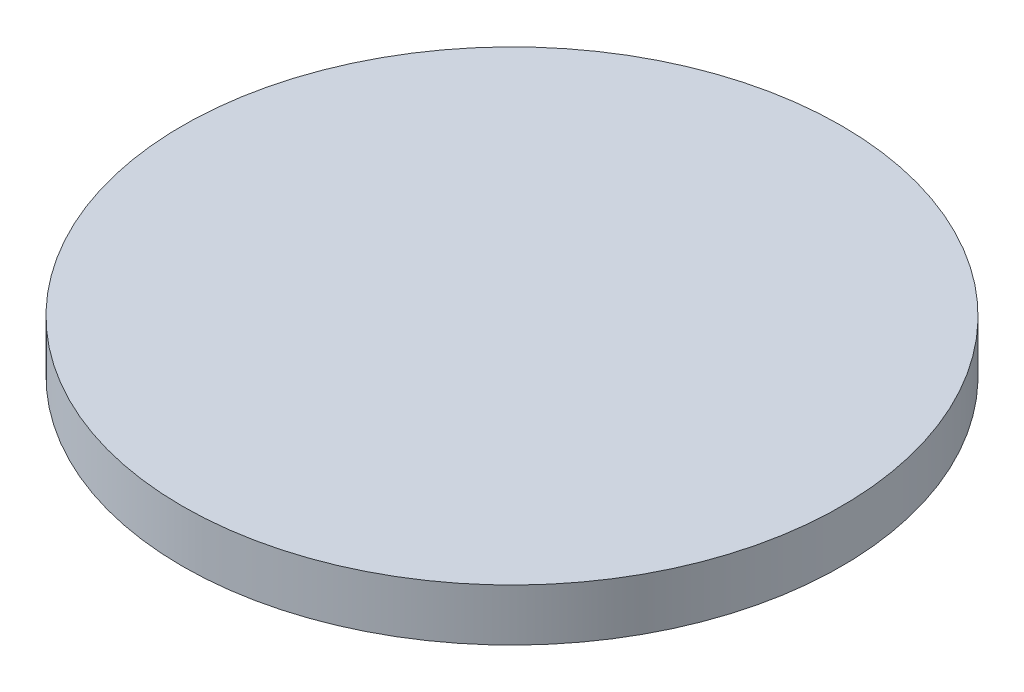
ISO-10303-21;
HEADER;
FILE_DESCRIPTION(('STEP AP214'),'2;1');
FILE_NAME('part.step','',(''),(''),'','','');
FILE_SCHEMA(('AUTOMOTIVE_DESIGN { 1 0 10303 214 1 1 1 1 }'));
ENDSEC;
DATA;
#1=APPLICATION_CONTEXT('core data for automotive mechanical design processes');
#2=APPLICATION_PROTOCOL_DEFINITION('international standard','automotive_design',2000,#1);
#3=PRODUCT_CONTEXT('',#1,'mechanical');
#4=PRODUCT('Part','Part','',(#3));
#5=PRODUCT_RELATED_PRODUCT_CATEGORY('part','',(#4));
#6=PRODUCT_DEFINITION_FORMATION('','',#4);
#7=PRODUCT_DEFINITION_CONTEXT('part definition',#1,'design');
#8=PRODUCT_DEFINITION('design','',#6,#7);
#9=PRODUCT_DEFINITION_SHAPE('','',#8);
#10=(LENGTH_UNIT() NAMED_UNIT(*) SI_UNIT(.MILLI.,.METRE.));
#11=(NAMED_UNIT(*) PLANE_ANGLE_UNIT() SI_UNIT($,.RADIAN.));
#12=(NAMED_UNIT(*) SI_UNIT($,.STERADIAN.) SOLID_ANGLE_UNIT());
#13=UNCERTAINTY_MEASURE_WITH_UNIT(LENGTH_MEASURE(1.E-05),#10,'distance_accuracy_value','');
#14=(GEOMETRIC_REPRESENTATION_CONTEXT(3) GLOBAL_UNCERTAINTY_ASSIGNED_CONTEXT((#13)) GLOBAL_UNIT_ASSIGNED_CONTEXT((#10,
#11,#12)) REPRESENTATION_CONTEXT('',''));
#15=CARTESIAN_POINT('',(0.,0.,0.));
#16=DIRECTION('',(0.,0.,1.));
#17=DIRECTION('',(1.,0.,0.));
#18=AXIS2_PLACEMENT_3D('',#15,#16,#17);
#19=CARTESIAN_POINT('',(0.,1.5,0.));
#20=DIRECTION('',(0.,-1.,0.));
#21=DIRECTION('',(0.,0.,-1.));
#22=AXIS2_PLACEMENT_3D('',#19,#20,#21);
#23=CYLINDRICAL_SURFACE('',#22,9.5);
#24=CARTESIAN_POINT('',(0.,1.5,0.));
#25=DIRECTION('',(0.,1.,0.));
#26=DIRECTION('',(0.,0.,1.));
#27=AXIS2_PLACEMENT_3D('',#24,#25,#26);
#28=CIRCLE('',#27,9.5);
#29=CARTESIAN_POINT('',(0.,1.5,9.5));
#30=VERTEX_POINT('',#29);
#31=EDGE_CURVE('E10',#30,#30,#28,.T.);
#32=ORIENTED_EDGE('',*,*,#31,.F.);
#33=EDGE_LOOP('',(#32));
#34=FACE_BOUND('',#33,.T.);
#35=CARTESIAN_POINT('',(0.,0.,0.));
#36=DIRECTION('',(0.,1.,0.));
#37=DIRECTION('',(0.,0.,1.));
#38=AXIS2_PLACEMENT_3D('',#35,#36,#37);
#39=CIRCLE('',#38,9.5);
#40=CARTESIAN_POINT('',(0.,0.,9.5));
#41=VERTEX_POINT('',#40);
#42=EDGE_CURVE('E17',#41,#41,#39,.T.);
#43=ORIENTED_EDGE('',*,*,#42,.T.);
#44=EDGE_LOOP('',(#43));
#45=FACE_BOUND('',#44,.T.);
#46=ADVANCED_FACE('F14',(#34,#45),#23,.T.);
#47=CARTESIAN_POINT('',(0.,1.5,0.));
#48=DIRECTION('',(0.,1.,0.));
#49=DIRECTION('',(0.,0.,1.));
#50=AXIS2_PLACEMENT_3D('',#47,#48,#49);
#51=PLANE('',#50);
#52=ORIENTED_EDGE('',*,*,#31,.T.);
#53=EDGE_LOOP('',(#52));
#54=FACE_BOUND('',#53,.T.);
#55=ADVANCED_FACE('F29',(#54),#51,.T.);
#56=CARTESIAN_POINT('',(0.,0.,0.));
#57=DIRECTION('',(0.,1.,0.));
#58=DIRECTION('',(0.,0.,1.));
#59=AXIS2_PLACEMENT_3D('',#56,#57,#58);
#60=PLANE('',#59);
#61=ORIENTED_EDGE('',*,*,#42,.F.);
#62=EDGE_LOOP('',(#61));
#63=FACE_BOUND('',#62,.T.);
#64=ADVANCED_FACE('F27',(#63),#60,.F.);
#65=CLOSED_SHELL('',(#46,#55,#64));
#66=MANIFOLD_SOLID_BREP('B1',#65);
#67=ADVANCED_BREP_SHAPE_REPRESENTATION('',(#18,#66),#14);
#68=SHAPE_DEFINITION_REPRESENTATION(#9,#67);
ENDSEC;
END-ISO-10303-21;
